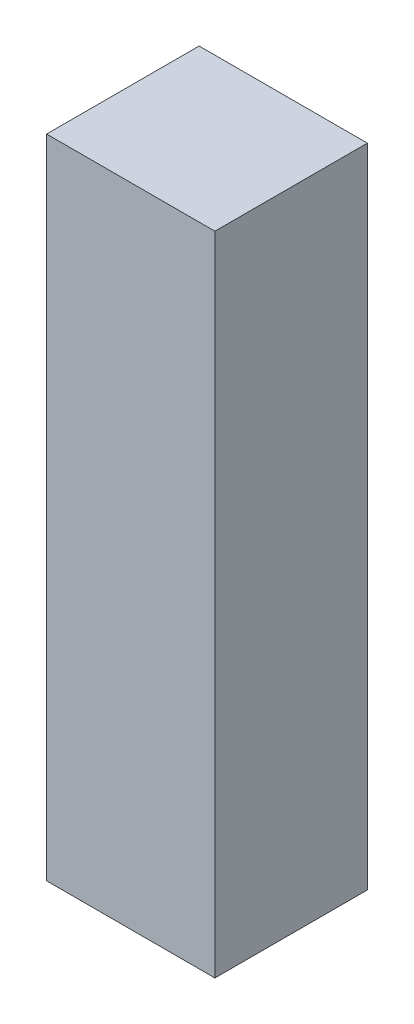
ISO-10303-21;
HEADER;
FILE_DESCRIPTION(('STEP AP214'),'2;1');
FILE_NAME('part.step','',(''),(''),'','','');
FILE_SCHEMA(('AUTOMOTIVE_DESIGN { 1 0 10303 214 1 1 1 1 }'));
ENDSEC;
DATA;
#1=APPLICATION_CONTEXT('core data for automotive mechanical design processes');
#2=APPLICATION_PROTOCOL_DEFINITION('international standard','automotive_design',2000,#1);
#3=PRODUCT_CONTEXT('',#1,'mechanical');
#4=PRODUCT('Part','Part','',(#3));
#5=PRODUCT_RELATED_PRODUCT_CATEGORY('part','',(#4));
#6=PRODUCT_DEFINITION_FORMATION('','',#4);
#7=PRODUCT_DEFINITION_CONTEXT('part definition',#1,'design');
#8=PRODUCT_DEFINITION('design','',#6,#7);
#9=PRODUCT_DEFINITION_SHAPE('','',#8);
#10=(LENGTH_UNIT() NAMED_UNIT(*) SI_UNIT(.MILLI.,.METRE.));
#11=(NAMED_UNIT(*) PLANE_ANGLE_UNIT() SI_UNIT($,.RADIAN.));
#12=(NAMED_UNIT(*) SI_UNIT($,.STERADIAN.) SOLID_ANGLE_UNIT());
#13=UNCERTAINTY_MEASURE_WITH_UNIT(LENGTH_MEASURE(1.E-05),#10,'distance_accuracy_value','');
#14=(GEOMETRIC_REPRESENTATION_CONTEXT(3) GLOBAL_UNCERTAINTY_ASSIGNED_CONTEXT((#13)) GLOBAL_UNIT_ASSIGNED_CONTEXT((#10,
#11,#12)) REPRESENTATION_CONTEXT('',''));
#15=CARTESIAN_POINT('',(0.,0.,0.));
#16=DIRECTION('',(0.,0.,1.));
#17=DIRECTION('',(1.,0.,0.));
#18=AXIS2_PLACEMENT_3D('',#15,#16,#17);
#19=CARTESIAN_POINT('',(8.128,-31.242,14.732));
#20=DIRECTION('',(0.,1.,0.));
#21=DIRECTION('',(0.,0.,1.));
#22=AXIS2_PLACEMENT_3D('',#19,#20,#21);
#23=PLANE('',#22);
#24=DIRECTION('',(1.,0.,0.));
#25=VECTOR('',#24,1.);
#26=CARTESIAN_POINT('',(8.128,-31.242,0.));
#27=LINE('',#26,#25);
#28=CARTESIAN_POINT('',(-8.128,-31.242,0.));
#29=VERTEX_POINT('',#28);
#30=CARTESIAN_POINT('',(8.128,-31.242,0.));
#31=VERTEX_POINT('',#30);
#32=EDGE_CURVE('E113',#29,#31,#27,.T.);
#33=ORIENTED_EDGE('',*,*,#32,.T.);
#34=DIRECTION('',(0.,0.,-1.));
#35=VECTOR('',#34,1.);
#36=CARTESIAN_POINT('',(8.128,-31.242,14.732));
#37=LINE('',#36,#35);
#38=CARTESIAN_POINT('',(8.128,-31.242,14.732));
#39=VERTEX_POINT('',#38);
#40=EDGE_CURVE('E11',#39,#31,#37,.T.);
#41=ORIENTED_EDGE('',*,*,#40,.F.);
#42=DIRECTION('',(1.,0.,0.));
#43=VECTOR('',#42,1.);
#44=CARTESIAN_POINT('',(8.128,-31.242,14.732));
#45=LINE('',#44,#43);
#46=CARTESIAN_POINT('',(-8.128,-31.242,14.732));
#47=VERTEX_POINT('',#46);
#48=EDGE_CURVE('E97',#47,#39,#45,.T.);
#49=ORIENTED_EDGE('',*,*,#48,.F.);
#50=DIRECTION('',(0.,0.,-1.));
#51=VECTOR('',#50,1.);
#52=CARTESIAN_POINT('',(-8.128,-31.242,14.732));
#53=LINE('',#52,#51);
#54=EDGE_CURVE('E109',#47,#29,#53,.T.);
#55=ORIENTED_EDGE('',*,*,#54,.T.);
#56=EDGE_LOOP('',(#33,#41,#49,#55));
#57=FACE_BOUND('',#56,.T.);
#58=ADVANCED_FACE('F45',(#57),#23,.F.);
#59=CARTESIAN_POINT('',(8.128,31.242,14.732));
#60=DIRECTION('',(-1.,0.,0.));
#61=DIRECTION('',(0.,-1.,0.));
#62=AXIS2_PLACEMENT_3D('',#59,#60,#61);
#63=PLANE('',#62);
#64=DIRECTION('',(0.,1.,0.));
#65=VECTOR('',#64,1.);
#66=CARTESIAN_POINT('',(8.128,31.242,0.));
#67=LINE('',#66,#65);
#68=CARTESIAN_POINT('',(8.128,31.242,0.));
#69=VERTEX_POINT('',#68);
#70=EDGE_CURVE('E102',#31,#69,#67,.T.);
#71=ORIENTED_EDGE('',*,*,#70,.T.);
#72=DIRECTION('',(0.,0.,-1.));
#73=VECTOR('',#72,1.);
#74=CARTESIAN_POINT('',(8.128,31.242,14.732));
#75=LINE('',#74,#73);
#76=CARTESIAN_POINT('',(8.128,31.242,14.732));
#77=VERTEX_POINT('',#76);
#78=EDGE_CURVE('E54',#77,#69,#75,.T.);
#79=ORIENTED_EDGE('',*,*,#78,.F.);
#80=DIRECTION('',(0.,1.,0.));
#81=VECTOR('',#80,1.);
#82=CARTESIAN_POINT('',(8.128,31.242,14.732));
#83=LINE('',#82,#81);
#84=EDGE_CURVE('E92',#39,#77,#83,.T.);
#85=ORIENTED_EDGE('',*,*,#84,.F.);
#86=ORIENTED_EDGE('',*,*,#40,.T.);
#87=EDGE_LOOP('',(#71,#79,#85,#86));
#88=FACE_BOUND('',#87,.T.);
#89=ADVANCED_FACE('F101',(#88),#63,.F.);
#90=CARTESIAN_POINT('',(8.128,31.242,14.732));
#91=DIRECTION('',(0.,-1.,0.));
#92=DIRECTION('',(0.,0.,-1.));
#93=AXIS2_PLACEMENT_3D('',#90,#91,#92);
#94=PLANE('',#93);
#95=DIRECTION('',(-1.,0.,0.));
#96=VECTOR('',#95,1.);
#97=CARTESIAN_POINT('',(8.128,31.242,0.));
#98=LINE('',#97,#96);
#99=CARTESIAN_POINT('',(-8.128,31.242,0.));
#100=VERTEX_POINT('',#99);
#101=EDGE_CURVE('E79',#69,#100,#98,.T.);
#102=ORIENTED_EDGE('',*,*,#101,.T.);
#103=DIRECTION('',(0.,0.,-1.));
#104=VECTOR('',#103,1.);
#105=CARTESIAN_POINT('',(-8.128,31.242,14.732));
#106=LINE('',#105,#104);
#107=CARTESIAN_POINT('',(-8.128,31.242,14.732));
#108=VERTEX_POINT('',#107);
#109=EDGE_CURVE('E104',#108,#100,#106,.T.);
#110=ORIENTED_EDGE('',*,*,#109,.F.);
#111=DIRECTION('',(-1.,0.,0.));
#112=VECTOR('',#111,1.);
#113=CARTESIAN_POINT('',(8.128,31.242,14.732));
#114=LINE('',#113,#112);
#115=EDGE_CURVE('E95',#77,#108,#114,.T.);
#116=ORIENTED_EDGE('',*,*,#115,.F.);
#117=ORIENTED_EDGE('',*,*,#78,.T.);
#118=EDGE_LOOP('',(#102,#110,#116,#117));
#119=FACE_BOUND('',#118,.T.);
#120=ADVANCED_FACE('F105',(#119),#94,.F.);
#121=CARTESIAN_POINT('',(-8.128,31.242,14.732));
#122=DIRECTION('',(1.,0.,0.));
#123=DIRECTION('',(0.,1.,0.));
#124=AXIS2_PLACEMENT_3D('',#121,#122,#123);
#125=PLANE('',#124);
#126=DIRECTION('',(0.,-1.,0.));
#127=VECTOR('',#126,1.);
#128=CARTESIAN_POINT('',(-8.128,31.242,0.));
#129=LINE('',#128,#127);
#130=EDGE_CURVE('E85',#100,#29,#129,.T.);
#131=ORIENTED_EDGE('',*,*,#130,.T.);
#132=ORIENTED_EDGE('',*,*,#54,.F.);
#133=DIRECTION('',(0.,-1.,0.));
#134=VECTOR('',#133,1.);
#135=CARTESIAN_POINT('',(-8.128,31.242,14.732));
#136=LINE('',#135,#134);
#137=EDGE_CURVE('E62',#108,#47,#136,.T.);
#138=ORIENTED_EDGE('',*,*,#137,.F.);
#139=ORIENTED_EDGE('',*,*,#109,.T.);
#140=EDGE_LOOP('',(#131,#132,#138,#139));
#141=FACE_BOUND('',#140,.T.);
#142=ADVANCED_FACE('F126',(#141),#125,.F.);
#143=CARTESIAN_POINT('',(0.,0.,14.732));
#144=DIRECTION('',(0.,0.,1.));
#145=DIRECTION('',(1.,0.,0.));
#146=AXIS2_PLACEMENT_3D('',#143,#144,#145);
#147=PLANE('',#146);
#148=ORIENTED_EDGE('',*,*,#48,.T.);
#149=ORIENTED_EDGE('',*,*,#84,.T.);
#150=ORIENTED_EDGE('',*,*,#115,.T.);
#151=ORIENTED_EDGE('',*,*,#137,.T.);
#152=EDGE_LOOP('',(#148,#149,#150,#151));
#153=FACE_BOUND('',#152,.T.);
#154=ADVANCED_FACE('F93',(#153),#147,.T.);
#155=CARTESIAN_POINT('',(0.,0.,0.));
#156=DIRECTION('',(0.,0.,1.));
#157=DIRECTION('',(1.,0.,0.));
#158=AXIS2_PLACEMENT_3D('',#155,#156,#157);
#159=PLANE('',#158);
#160=ORIENTED_EDGE('',*,*,#32,.F.);
#161=ORIENTED_EDGE('',*,*,#130,.F.);
#162=ORIENTED_EDGE('',*,*,#101,.F.);
#163=ORIENTED_EDGE('',*,*,#70,.F.);
#164=EDGE_LOOP('',(#160,#161,#162,#163));
#165=FACE_BOUND('',#164,.T.);
#166=ADVANCED_FACE('F129',(#165),#159,.F.);
#167=CLOSED_SHELL('',(#58,#89,#120,#142,#154,#166));
#168=MANIFOLD_SOLID_BREP('B2',#167);
#169=ADVANCED_BREP_SHAPE_REPRESENTATION('',(#18,#168),#14);
#170=SHAPE_DEFINITION_REPRESENTATION(#9,#169);
ENDSEC;
END-ISO-10303-21;
